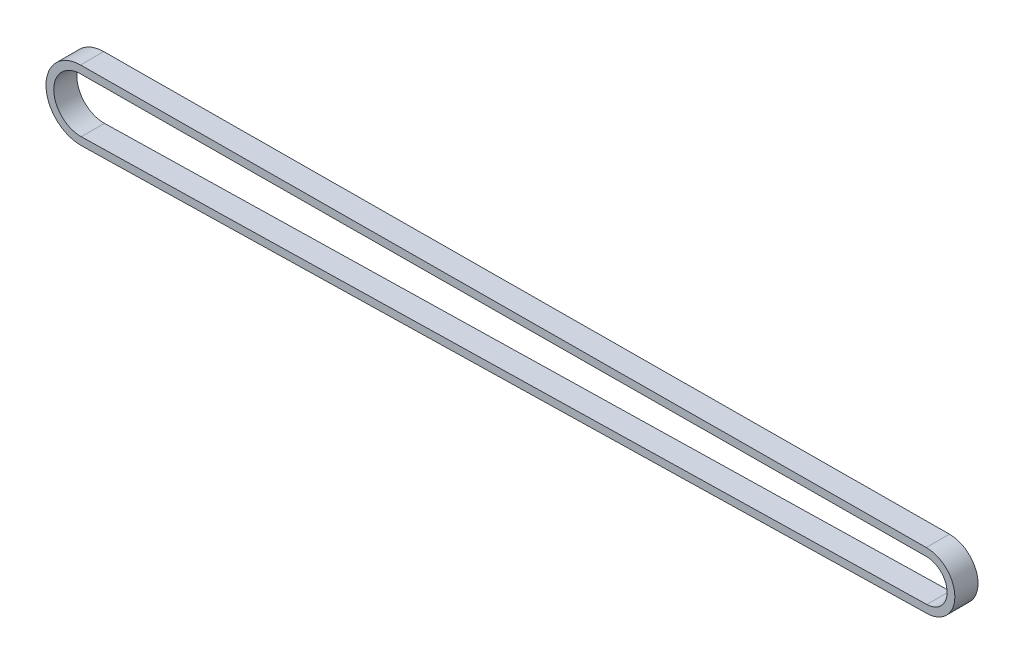
ISO-10303-21;
HEADER;
FILE_DESCRIPTION(('STEP AP214'),'2;1');
FILE_NAME('part.step','',(''),(''),'','','');
FILE_SCHEMA(('AUTOMOTIVE_DESIGN { 1 0 10303 214 1 1 1 1 }'));
ENDSEC;
DATA;
#1=APPLICATION_CONTEXT('core data for automotive mechanical design processes');
#2=APPLICATION_PROTOCOL_DEFINITION('international standard','automotive_design',2000,#1);
#3=PRODUCT_CONTEXT('',#1,'mechanical');
#4=PRODUCT('Part','Part','',(#3));
#5=PRODUCT_RELATED_PRODUCT_CATEGORY('part','',(#4));
#6=PRODUCT_DEFINITION_FORMATION('','',#4);
#7=PRODUCT_DEFINITION_CONTEXT('part definition',#1,'design');
#8=PRODUCT_DEFINITION('design','',#6,#7);
#9=PRODUCT_DEFINITION_SHAPE('','',#8);
#10=(LENGTH_UNIT() NAMED_UNIT(*) SI_UNIT(.MILLI.,.METRE.));
#11=(NAMED_UNIT(*) PLANE_ANGLE_UNIT() SI_UNIT($,.RADIAN.));
#12=(NAMED_UNIT(*) SI_UNIT($,.STERADIAN.) SOLID_ANGLE_UNIT());
#13=UNCERTAINTY_MEASURE_WITH_UNIT(LENGTH_MEASURE(1.E-05),#10,'distance_accuracy_value','');
#14=(GEOMETRIC_REPRESENTATION_CONTEXT(3) GLOBAL_UNCERTAINTY_ASSIGNED_CONTEXT((#13)) GLOBAL_UNIT_ASSIGNED_CONTEXT((#10,
#11,#12)) REPRESENTATION_CONTEXT('',''));
#15=CARTESIAN_POINT('',(0.,0.,0.));
#16=DIRECTION('',(0.,0.,1.));
#17=DIRECTION('',(1.,0.,0.));
#18=AXIS2_PLACEMENT_3D('',#15,#16,#17);
#19=CARTESIAN_POINT('',(110.323223304698,2.2869701706025,6.));
#20=DIRECTION('',(0.,0.,-1.));
#21=DIRECTION('',(-1.,0.,0.));
#22=AXIS2_PLACEMENT_3D('',#19,#20,#21);
#23=PLANE('',#22);
#24=CARTESIAN_POINT('',(110.323223304698,2.2869701706025,6.));
#25=DIRECTION('',(0.,0.,1.));
#26=DIRECTION('',(-1.,0.,0.));
#27=AXIS2_PLACEMENT_3D('',#24,#25,#26);
#28=CIRCLE('',#27,7.35355339059);
#29=CARTESIAN_POINT('',(110.476785040235,-5.06497965659548,6.));
#30=VERTEX_POINT('',#29);
#31=CARTESIAN_POINT('',(110.280210153406,9.64039776167006,6.));
#32=VERTEX_POINT('',#31);
#33=EDGE_CURVE('E157',#30,#32,#28,.T.);
#34=ORIENTED_EDGE('',*,*,#33,.T.);
#35=DIRECTION('',(-0.999982892689321,-0.00584930155634842,0.));
#36=VECTOR('',#35,1.);
#37=CARTESIAN_POINT('',(-108.729420409295,8.35932247301139,6.));
#38=LINE('',#37,#36);
#39=CARTESIAN_POINT('',(-108.729420409295,8.35932247301139,6.));
#40=VERTEX_POINT('',#39);
#41=EDGE_CURVE('E161',#32,#40,#38,.T.);
#42=ORIENTED_EDGE('',*,*,#41,.T.);
#43=CARTESIAN_POINT('',(-108.676776695288,-0.640523561192503,6.));
#44=DIRECTION('',(0.,0.,1.));
#45=DIRECTION('',(-1.,0.,0.));
#46=AXIS2_PLACEMENT_3D('',#43,#44,#45);
#47=CIRCLE('',#46,9.);
#48=CARTESIAN_POINT('',(-108.488832779412,-9.6385609630088,6.));
#49=VERTEX_POINT('',#48);
#50=EDGE_CURVE('E165',#40,#49,#47,.T.);
#51=ORIENTED_EDGE('',*,*,#50,.T.);
#52=DIRECTION('',(0.999781933535144,0.0208826573196178,0.));
#53=VECTOR('',#52,1.);
#54=CARTESIAN_POINT('',(110.476785040235,-5.06497965659548,6.));
#55=LINE('',#54,#53);
#56=EDGE_CURVE('E168',#49,#30,#55,.T.);
#57=ORIENTED_EDGE('',*,*,#56,.T.);
#58=EDGE_LOOP('',(#34,#42,#51,#57));
#59=FACE_BOUND('',#58,.T.);
#60=CARTESIAN_POINT('',(-108.676776695288,-0.640523561192503,6.));
#61=DIRECTION('',(0.,0.,1.));
#62=DIRECTION('',(-1.,0.,0.));
#63=AXIS2_PLACEMENT_3D('',#60,#61,#62);
#64=CIRCLE('',#63,7.);
#65=CARTESIAN_POINT('',(-108.717721806183,6.35935668763275,6.));
#66=VERTEX_POINT('',#65);
#67=CARTESIAN_POINT('',(-108.530598094051,-7.63899709593851,6.));
#68=VERTEX_POINT('',#67);
#69=EDGE_CURVE('E109',#66,#68,#64,.T.);
#70=ORIENTED_EDGE('',*,*,#69,.F.);
#71=DIRECTION('',(-0.999982892689321,-0.00584930155634843,0.));
#72=VECTOR('',#71,1.);
#73=CARTESIAN_POINT('',(-108.717721806183,6.35935668763275,6.));
#74=LINE('',#73,#72);
#75=CARTESIAN_POINT('',(110.291908756519,7.64043197629142,6.));
#76=VERTEX_POINT('',#75);
#77=EDGE_CURVE('E135',#76,#66,#74,.T.);
#78=ORIENTED_EDGE('',*,*,#77,.F.);
#79=CARTESIAN_POINT('',(110.323223304698,2.2869701706025,6.));
#80=DIRECTION('',(0.,0.,1.));
#81=DIRECTION('',(-1.,0.,0.));
#82=AXIS2_PLACEMENT_3D('',#79,#80,#81);
#83=CIRCLE('',#82,5.35355339059);
#84=CARTESIAN_POINT('',(110.435019725596,-3.06541578952519,6.));
#85=VERTEX_POINT('',#84);
#86=EDGE_CURVE('E131',#85,#76,#83,.T.);
#87=ORIENTED_EDGE('',*,*,#86,.F.);
#88=DIRECTION('',(0.999781933535144,0.0208826573196179,0.));
#89=VECTOR('',#88,1.);
#90=CARTESIAN_POINT('',(110.435019725596,-3.06541578952519,6.));
#91=LINE('',#90,#89);
#92=EDGE_CURVE('E118',#68,#85,#91,.T.);
#93=ORIENTED_EDGE('',*,*,#92,.F.);
#94=EDGE_LOOP('',(#70,#78,#87,#93));
#95=FACE_BOUND('',#94,.T.);
#96=ADVANCED_FACE('F43',(#59,#95),#23,.F.);
#97=CARTESIAN_POINT('',(110.323223304698,2.2869701706025,0.));
#98=DIRECTION('',(0.,0.,-1.));
#99=DIRECTION('',(-1.,0.,0.));
#100=AXIS2_PLACEMENT_3D('',#97,#98,#99);
#101=PLANE('',#100);
#102=CARTESIAN_POINT('',(110.323223304698,2.2869701706025,0.));
#103=DIRECTION('',(0.,0.,1.));
#104=DIRECTION('',(-1.,0.,0.));
#105=AXIS2_PLACEMENT_3D('',#102,#103,#104);
#106=CIRCLE('',#105,7.35355339059);
#107=CARTESIAN_POINT('',(110.476785040235,-5.06497965659548,0.));
#108=VERTEX_POINT('',#107);
#109=CARTESIAN_POINT('',(110.280210153406,9.64039776167006,0.));
#110=VERTEX_POINT('',#109);
#111=EDGE_CURVE('E127',#108,#110,#106,.T.);
#112=ORIENTED_EDGE('',*,*,#111,.F.);
#113=DIRECTION('',(0.999781933535144,0.0208826573196178,0.));
#114=VECTOR('',#113,1.);
#115=CARTESIAN_POINT('',(110.476785040235,-5.06497965659548,0.));
#116=LINE('',#115,#114);
#117=CARTESIAN_POINT('',(-108.488832779412,-9.6385609630088,0.));
#118=VERTEX_POINT('',#117);
#119=EDGE_CURVE('E162',#118,#108,#116,.T.);
#120=ORIENTED_EDGE('',*,*,#119,.F.);
#121=CARTESIAN_POINT('',(-108.676776695288,-0.640523561192503,0.));
#122=DIRECTION('',(0.,0.,1.));
#123=DIRECTION('',(-1.,0.,0.));
#124=AXIS2_PLACEMENT_3D('',#121,#122,#123);
#125=CIRCLE('',#124,9.);
#126=CARTESIAN_POINT('',(-108.729420409295,8.35932247301139,0.));
#127=VERTEX_POINT('',#126);
#128=EDGE_CURVE('E178',#127,#118,#125,.T.);
#129=ORIENTED_EDGE('',*,*,#128,.F.);
#130=DIRECTION('',(-0.999982892689321,-0.00584930155634842,0.));
#131=VECTOR('',#130,1.);
#132=CARTESIAN_POINT('',(-108.729420409295,8.35932247301139,0.));
#133=LINE('',#132,#131);
#134=EDGE_CURVE('E175',#110,#127,#133,.T.);
#135=ORIENTED_EDGE('',*,*,#134,.F.);
#136=EDGE_LOOP('',(#112,#120,#129,#135));
#137=FACE_BOUND('',#136,.T.);
#138=DIRECTION('',(-0.999982892689321,-0.00584930155634843,0.));
#139=VECTOR('',#138,1.);
#140=CARTESIAN_POINT('',(-108.717721806183,6.35935668763275,0.));
#141=LINE('',#140,#139);
#142=CARTESIAN_POINT('',(110.291908756519,7.64043197629142,0.));
#143=VERTEX_POINT('',#142);
#144=CARTESIAN_POINT('',(-108.717721806183,6.35935668763275,0.));
#145=VERTEX_POINT('',#144);
#146=EDGE_CURVE('E119',#143,#145,#141,.T.);
#147=ORIENTED_EDGE('',*,*,#146,.T.);
#148=CARTESIAN_POINT('',(-108.676776695288,-0.640523561192503,0.));
#149=DIRECTION('',(0.,0.,1.));
#150=DIRECTION('',(-1.,0.,0.));
#151=AXIS2_PLACEMENT_3D('',#148,#149,#150);
#152=CIRCLE('',#151,7.);
#153=CARTESIAN_POINT('',(-108.530598094051,-7.63899709593851,0.));
#154=VERTEX_POINT('',#153);
#155=EDGE_CURVE('E67',#145,#154,#152,.T.);
#156=ORIENTED_EDGE('',*,*,#155,.T.);
#157=DIRECTION('',(0.999781933535144,0.0208826573196179,0.));
#158=VECTOR('',#157,1.);
#159=CARTESIAN_POINT('',(110.435019725596,-3.06541578952519,0.));
#160=LINE('',#159,#158);
#161=CARTESIAN_POINT('',(110.435019725596,-3.06541578952519,0.));
#162=VERTEX_POINT('',#161);
#163=EDGE_CURVE('E125',#154,#162,#160,.T.);
#164=ORIENTED_EDGE('',*,*,#163,.T.);
#165=CARTESIAN_POINT('',(110.323223304698,2.2869701706025,0.));
#166=DIRECTION('',(0.,0.,1.));
#167=DIRECTION('',(-1.,0.,0.));
#168=AXIS2_PLACEMENT_3D('',#165,#166,#167);
#169=CIRCLE('',#168,5.35355339059);
#170=EDGE_CURVE('E144',#162,#143,#169,.T.);
#171=ORIENTED_EDGE('',*,*,#170,.T.);
#172=EDGE_LOOP('',(#147,#156,#164,#171));
#173=FACE_BOUND('',#172,.T.);
#174=ADVANCED_FACE('F201',(#137,#173),#101,.T.);
#175=CARTESIAN_POINT('',(110.323223304698,2.2869701706025,6.));
#176=DIRECTION('',(0.,0.,-1.));
#177=DIRECTION('',(-1.,0.,0.));
#178=AXIS2_PLACEMENT_3D('',#175,#176,#177);
#179=CYLINDRICAL_SURFACE('',#178,7.35355339059);
#180=ORIENTED_EDGE('',*,*,#111,.T.);
#181=DIRECTION('',(0.,0.,-1.));
#182=VECTOR('',#181,1.);
#183=CARTESIAN_POINT('',(110.280210153406,9.64039776167006,6.));
#184=LINE('',#183,#182);
#185=EDGE_CURVE('E11',#32,#110,#184,.T.);
#186=ORIENTED_EDGE('',*,*,#185,.F.);
#187=ORIENTED_EDGE('',*,*,#33,.F.);
#188=DIRECTION('',(0.,0.,-1.));
#189=VECTOR('',#188,1.);
#190=CARTESIAN_POINT('',(110.476785040235,-5.06497965659548,6.));
#191=LINE('',#190,#189);
#192=EDGE_CURVE('E171',#30,#108,#191,.T.);
#193=ORIENTED_EDGE('',*,*,#192,.T.);
#194=EDGE_LOOP('',(#180,#186,#187,#193));
#195=FACE_BOUND('',#194,.T.);
#196=ADVANCED_FACE('F45',(#195),#179,.T.);
#197=CARTESIAN_POINT('',(-108.729420409295,8.35932247301139,6.));
#198=DIRECTION('',(0.00584930155634842,-0.999982892689321,0.));
#199=DIRECTION('',(0.999982892689321,0.00584930155634842,0.));
#200=AXIS2_PLACEMENT_3D('',#197,#198,#199);
#201=PLANE('',#200);
#202=ORIENTED_EDGE('',*,*,#134,.T.);
#203=DIRECTION('',(0.,0.,-1.));
#204=VECTOR('',#203,1.);
#205=CARTESIAN_POINT('',(-108.729420409295,8.35932247301139,6.));
#206=LINE('',#205,#204);
#207=EDGE_CURVE('E52',#40,#127,#206,.T.);
#208=ORIENTED_EDGE('',*,*,#207,.F.);
#209=ORIENTED_EDGE('',*,*,#41,.F.);
#210=ORIENTED_EDGE('',*,*,#185,.T.);
#211=EDGE_LOOP('',(#202,#208,#209,#210));
#212=FACE_BOUND('',#211,.T.);
#213=ADVANCED_FACE('F211',(#212),#201,.F.);
#214=CARTESIAN_POINT('',(-108.676776695288,-0.640523561192503,6.));
#215=DIRECTION('',(0.,0.,-1.));
#216=DIRECTION('',(-1.,0.,0.));
#217=AXIS2_PLACEMENT_3D('',#214,#215,#216);
#218=CYLINDRICAL_SURFACE('',#217,9.);
#219=ORIENTED_EDGE('',*,*,#128,.T.);
#220=DIRECTION('',(0.,0.,-1.));
#221=VECTOR('',#220,1.);
#222=CARTESIAN_POINT('',(-108.488832779412,-9.6385609630088,6.));
#223=LINE('',#222,#221);
#224=EDGE_CURVE('E186',#49,#118,#223,.T.);
#225=ORIENTED_EDGE('',*,*,#224,.F.);
#226=ORIENTED_EDGE('',*,*,#50,.F.);
#227=ORIENTED_EDGE('',*,*,#207,.T.);
#228=EDGE_LOOP('',(#219,#225,#226,#227));
#229=FACE_BOUND('',#228,.T.);
#230=ADVANCED_FACE('F195',(#229),#218,.T.);
#231=CARTESIAN_POINT('',(110.476785040235,-5.06497965659548,6.));
#232=DIRECTION('',(-0.0208826573196178,0.999781933535144,0.));
#233=DIRECTION('',(-0.999781933535144,-0.0208826573196178,0.));
#234=AXIS2_PLACEMENT_3D('',#231,#232,#233);
#235=PLANE('',#234);
#236=ORIENTED_EDGE('',*,*,#119,.T.);
#237=ORIENTED_EDGE('',*,*,#192,.F.);
#238=ORIENTED_EDGE('',*,*,#56,.F.);
#239=ORIENTED_EDGE('',*,*,#224,.T.);
#240=EDGE_LOOP('',(#236,#237,#238,#239));
#241=FACE_BOUND('',#240,.T.);
#242=ADVANCED_FACE('F205',(#241),#235,.F.);
#243=CARTESIAN_POINT('',(-108.676776695288,-0.640523561192503,6.));
#244=DIRECTION('',(0.,0.,-1.));
#245=DIRECTION('',(-1.,0.,0.));
#246=AXIS2_PLACEMENT_3D('',#243,#244,#245);
#247=CYLINDRICAL_SURFACE('',#246,7.);
#248=ORIENTED_EDGE('',*,*,#155,.F.);
#249=DIRECTION('',(0.,0.,-1.));
#250=VECTOR('',#249,1.);
#251=CARTESIAN_POINT('',(-108.717721806183,6.35935668763275,6.));
#252=LINE('',#251,#250);
#253=EDGE_CURVE('E113',#66,#145,#252,.T.);
#254=ORIENTED_EDGE('',*,*,#253,.F.);
#255=ORIENTED_EDGE('',*,*,#69,.T.);
#256=DIRECTION('',(0.,0.,-1.));
#257=VECTOR('',#256,1.);
#258=CARTESIAN_POINT('',(-108.530598094051,-7.63899709593851,6.));
#259=LINE('',#258,#257);
#260=EDGE_CURVE('E112',#68,#154,#259,.T.);
#261=ORIENTED_EDGE('',*,*,#260,.T.);
#262=EDGE_LOOP('',(#248,#254,#255,#261));
#263=FACE_BOUND('',#262,.T.);
#264=ADVANCED_FACE('F111',(#263),#247,.F.);
#265=CARTESIAN_POINT('',(110.435019725596,-3.06541578952519,6.));
#266=DIRECTION('',(-0.0208826573196179,0.999781933535144,0.));
#267=DIRECTION('',(-0.999781933535144,-0.0208826573196179,0.));
#268=AXIS2_PLACEMENT_3D('',#265,#266,#267);
#269=PLANE('',#268);
#270=ORIENTED_EDGE('',*,*,#163,.F.);
#271=ORIENTED_EDGE('',*,*,#260,.F.);
#272=ORIENTED_EDGE('',*,*,#92,.T.);
#273=DIRECTION('',(0.,0.,-1.));
#274=VECTOR('',#273,1.);
#275=CARTESIAN_POINT('',(110.435019725596,-3.06541578952519,6.));
#276=LINE('',#275,#274);
#277=EDGE_CURVE('E128',#85,#162,#276,.T.);
#278=ORIENTED_EDGE('',*,*,#277,.T.);
#279=EDGE_LOOP('',(#270,#271,#272,#278));
#280=FACE_BOUND('',#279,.T.);
#281=ADVANCED_FACE('F122',(#280),#269,.T.);
#282=CARTESIAN_POINT('',(110.323223304698,2.2869701706025,6.));
#283=DIRECTION('',(0.,0.,-1.));
#284=DIRECTION('',(-1.,0.,0.));
#285=AXIS2_PLACEMENT_3D('',#282,#283,#284);
#286=CYLINDRICAL_SURFACE('',#285,5.35355339059);
#287=ORIENTED_EDGE('',*,*,#170,.F.);
#288=ORIENTED_EDGE('',*,*,#277,.F.);
#289=ORIENTED_EDGE('',*,*,#86,.T.);
#290=DIRECTION('',(0.,0.,-1.));
#291=VECTOR('',#290,1.);
#292=CARTESIAN_POINT('',(110.291908756519,7.64043197629142,6.));
#293=LINE('',#292,#291);
#294=EDGE_CURVE('E59',#76,#143,#293,.T.);
#295=ORIENTED_EDGE('',*,*,#294,.T.);
#296=EDGE_LOOP('',(#287,#288,#289,#295));
#297=FACE_BOUND('',#296,.T.);
#298=ADVANCED_FACE('F234',(#297),#286,.F.);
#299=CARTESIAN_POINT('',(-108.717721806183,6.35935668763275,6.));
#300=DIRECTION('',(0.00584930155634843,-0.999982892689321,0.));
#301=DIRECTION('',(0.999982892689321,0.00584930155634843,0.));
#302=AXIS2_PLACEMENT_3D('',#299,#300,#301);
#303=PLANE('',#302);
#304=ORIENTED_EDGE('',*,*,#146,.F.);
#305=ORIENTED_EDGE('',*,*,#294,.F.);
#306=ORIENTED_EDGE('',*,*,#77,.T.);
#307=ORIENTED_EDGE('',*,*,#253,.T.);
#308=EDGE_LOOP('',(#304,#305,#306,#307));
#309=FACE_BOUND('',#308,.T.);
#310=ADVANCED_FACE('F238',(#309),#303,.T.);
#311=CLOSED_SHELL('',(#96,#174,#196,#213,#230,#242,#264,#281,#298,#310));
#312=MANIFOLD_SOLID_BREP('B2',#311);
#313=ADVANCED_BREP_SHAPE_REPRESENTATION('',(#18,#312),#14);
#314=SHAPE_DEFINITION_REPRESENTATION(#9,#313);
ENDSEC;
END-ISO-10303-21;
